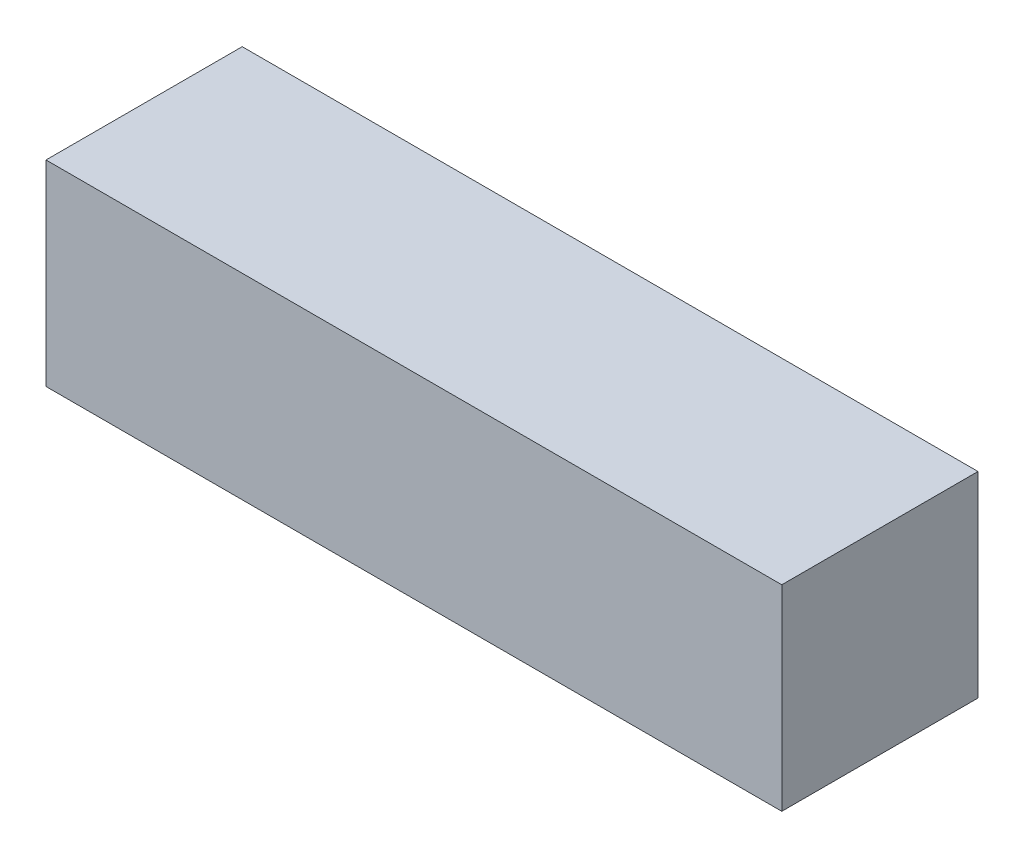
ISO-10303-21;
HEADER;
FILE_DESCRIPTION(('STEP AP214'),'2;1');
FILE_NAME('part.step','',(''),(''),'','','');
FILE_SCHEMA(('AUTOMOTIVE_DESIGN { 1 0 10303 214 1 1 1 1 }'));
ENDSEC;
DATA;
#1=APPLICATION_CONTEXT('core data for automotive mechanical design processes');
#2=APPLICATION_PROTOCOL_DEFINITION('international standard','automotive_design',2000,#1);
#3=PRODUCT_CONTEXT('',#1,'mechanical');
#4=PRODUCT('Part','Part','',(#3));
#5=PRODUCT_RELATED_PRODUCT_CATEGORY('part','',(#4));
#6=PRODUCT_DEFINITION_FORMATION('','',#4);
#7=PRODUCT_DEFINITION_CONTEXT('part definition',#1,'design');
#8=PRODUCT_DEFINITION('design','',#6,#7);
#9=PRODUCT_DEFINITION_SHAPE('','',#8);
#10=(LENGTH_UNIT() NAMED_UNIT(*) SI_UNIT(.MILLI.,.METRE.));
#11=(NAMED_UNIT(*) PLANE_ANGLE_UNIT() SI_UNIT($,.RADIAN.));
#12=(NAMED_UNIT(*) SI_UNIT($,.STERADIAN.) SOLID_ANGLE_UNIT());
#13=UNCERTAINTY_MEASURE_WITH_UNIT(LENGTH_MEASURE(1.E-05),#10,'distance_accuracy_value','');
#14=(GEOMETRIC_REPRESENTATION_CONTEXT(3) GLOBAL_UNCERTAINTY_ASSIGNED_CONTEXT((#13)) GLOBAL_UNIT_ASSIGNED_CONTEXT((#10,
#11,#12)) REPRESENTATION_CONTEXT('',''));
#15=CARTESIAN_POINT('',(0.,0.,0.));
#16=DIRECTION('',(0.,0.,1.));
#17=DIRECTION('',(1.,0.,0.));
#18=AXIS2_PLACEMENT_3D('',#15,#16,#17);
#19=CARTESIAN_POINT('',(-1.5,-1.7,0.2));
#20=DIRECTION('',(0.,1.,0.));
#21=DIRECTION('',(0.,0.,1.));
#22=AXIS2_PLACEMENT_3D('',#19,#20,#21);
#23=PLANE('',#22);
#24=DIRECTION('',(-1.,0.,0.));
#25=VECTOR('',#24,1.);
#26=CARTESIAN_POINT('',(-0.75,-1.7,0.));
#27=LINE('',#26,#25);
#28=CARTESIAN_POINT('',(-0.75,-1.7,0.));
#29=VERTEX_POINT('',#28);
#30=CARTESIAN_POINT('',(-2.25,-1.7,0.));
#31=VERTEX_POINT('',#30);
#32=EDGE_CURVE('E68',#29,#31,#27,.T.);
#33=ORIENTED_EDGE('',*,*,#32,.F.);
#34=DIRECTION('',(0.,0.,-1.));
#35=VECTOR('',#34,1.);
#36=CARTESIAN_POINT('',(-0.75,-1.7,0.4));
#37=LINE('',#36,#35);
#38=CARTESIAN_POINT('',(-0.75,-1.7,0.4));
#39=VERTEX_POINT('',#38);
#40=EDGE_CURVE('E55',#39,#29,#37,.T.);
#41=ORIENTED_EDGE('',*,*,#40,.F.);
#42=DIRECTION('',(1.,0.,0.));
#43=VECTOR('',#42,1.);
#44=CARTESIAN_POINT('',(-2.25,-1.7,0.4));
#45=LINE('',#44,#43);
#46=CARTESIAN_POINT('',(-2.25,-1.7,0.4));
#47=VERTEX_POINT('',#46);
#48=EDGE_CURVE('E20',#47,#39,#45,.T.);
#49=ORIENTED_EDGE('',*,*,#48,.F.);
#50=DIRECTION('',(0.,0.,1.));
#51=VECTOR('',#50,1.);
#52=CARTESIAN_POINT('',(-2.25,-1.7,0.));
#53=LINE('',#52,#51);
#54=EDGE_CURVE('E80',#31,#47,#53,.T.);
#55=ORIENTED_EDGE('',*,*,#54,.F.);
#56=EDGE_LOOP('',(#33,#41,#49,#55));
#57=FACE_BOUND('',#56,.T.);
#58=ADVANCED_FACE('F17',(#57),#23,.F.);
#59=CARTESIAN_POINT('',(-2.25,-1.3,0.4));
#60=DIRECTION('',(0.,0.,1.));
#61=DIRECTION('',(1.,0.,0.));
#62=AXIS2_PLACEMENT_3D('',#59,#60,#61);
#63=PLANE('',#62);
#64=DIRECTION('',(0.,1.,0.));
#65=VECTOR('',#64,1.);
#66=CARTESIAN_POINT('',(-0.75,-1.3,0.4));
#67=LINE('',#66,#65);
#68=CARTESIAN_POINT('',(-0.75,-1.3,0.4));
#69=VERTEX_POINT('',#68);
#70=EDGE_CURVE('E61',#69,#39,#67,.F.);
#71=ORIENTED_EDGE('',*,*,#70,.F.);
#72=DIRECTION('',(1.,0.,0.));
#73=VECTOR('',#72,1.);
#74=CARTESIAN_POINT('',(-1.5,-1.3,0.4));
#75=LINE('',#74,#73);
#76=CARTESIAN_POINT('',(-2.25,-1.3,0.4));
#77=VERTEX_POINT('',#76);
#78=EDGE_CURVE('E83',#77,#69,#75,.T.);
#79=ORIENTED_EDGE('',*,*,#78,.F.);
#80=DIRECTION('',(0.,1.,0.));
#81=VECTOR('',#80,1.);
#82=CARTESIAN_POINT('',(-2.25,-1.3,0.4));
#83=LINE('',#82,#81);
#84=EDGE_CURVE('E64',#47,#77,#83,.T.);
#85=ORIENTED_EDGE('',*,*,#84,.F.);
#86=ORIENTED_EDGE('',*,*,#48,.T.);
#87=EDGE_LOOP('',(#71,#79,#85,#86));
#88=FACE_BOUND('',#87,.T.);
#89=ADVANCED_FACE('F60',(#88),#63,.T.);
#90=CARTESIAN_POINT('',(-0.75,-1.3,0.4));
#91=DIRECTION('',(1.,0.,0.));
#92=DIRECTION('',(0.,0.,-1.));
#93=AXIS2_PLACEMENT_3D('',#90,#91,#92);
#94=PLANE('',#93);
#95=DIRECTION('',(0.,1.,0.));
#96=VECTOR('',#95,1.);
#97=CARTESIAN_POINT('',(-0.75,-1.3,0.));
#98=LINE('',#97,#96);
#99=CARTESIAN_POINT('',(-0.75,-1.3,0.));
#100=VERTEX_POINT('',#99);
#101=EDGE_CURVE('E70',#100,#29,#98,.F.);
#102=ORIENTED_EDGE('',*,*,#101,.F.);
#103=DIRECTION('',(0.,0.,1.));
#104=VECTOR('',#103,1.);
#105=CARTESIAN_POINT('',(-0.75,-1.3,0.2));
#106=LINE('',#105,#104);
#107=EDGE_CURVE('E74',#69,#100,#106,.F.);
#108=ORIENTED_EDGE('',*,*,#107,.F.);
#109=ORIENTED_EDGE('',*,*,#70,.T.);
#110=ORIENTED_EDGE('',*,*,#40,.T.);
#111=EDGE_LOOP('',(#102,#108,#109,#110));
#112=FACE_BOUND('',#111,.T.);
#113=ADVANCED_FACE('F72',(#112),#94,.T.);
#114=CARTESIAN_POINT('',(-0.75,-1.3,0.));
#115=DIRECTION('',(0.,0.,-1.));
#116=DIRECTION('',(-1.,0.,0.));
#117=AXIS2_PLACEMENT_3D('',#114,#115,#116);
#118=PLANE('',#117);
#119=DIRECTION('',(0.,1.,0.));
#120=VECTOR('',#119,1.);
#121=CARTESIAN_POINT('',(-2.25,-1.3,0.));
#122=LINE('',#121,#120);
#123=CARTESIAN_POINT('',(-2.25,-1.3,0.));
#124=VERTEX_POINT('',#123);
#125=EDGE_CURVE('E35',#124,#31,#122,.F.);
#126=ORIENTED_EDGE('',*,*,#125,.F.);
#127=DIRECTION('',(1.,0.,0.));
#128=VECTOR('',#127,1.);
#129=CARTESIAN_POINT('',(-1.5,-1.3,0.));
#130=LINE('',#129,#128);
#131=EDGE_CURVE('E26',#100,#124,#130,.F.);
#132=ORIENTED_EDGE('',*,*,#131,.F.);
#133=ORIENTED_EDGE('',*,*,#101,.T.);
#134=ORIENTED_EDGE('',*,*,#32,.T.);
#135=EDGE_LOOP('',(#126,#132,#133,#134));
#136=FACE_BOUND('',#135,.T.);
#137=ADVANCED_FACE('F89',(#136),#118,.T.);
#138=CARTESIAN_POINT('',(-2.25,-1.3,0.));
#139=DIRECTION('',(-1.,0.,0.));
#140=DIRECTION('',(0.,0.,1.));
#141=AXIS2_PLACEMENT_3D('',#138,#139,#140);
#142=PLANE('',#141);
#143=ORIENTED_EDGE('',*,*,#84,.T.);
#144=DIRECTION('',(0.,0.,1.));
#145=VECTOR('',#144,1.);
#146=CARTESIAN_POINT('',(-2.25,-1.3,0.2));
#147=LINE('',#146,#145);
#148=EDGE_CURVE('E11',#124,#77,#147,.T.);
#149=ORIENTED_EDGE('',*,*,#148,.F.);
#150=ORIENTED_EDGE('',*,*,#125,.T.);
#151=ORIENTED_EDGE('',*,*,#54,.T.);
#152=EDGE_LOOP('',(#143,#149,#150,#151));
#153=FACE_BOUND('',#152,.T.);
#154=ADVANCED_FACE('F91',(#153),#142,.T.);
#155=CARTESIAN_POINT('',(-1.5,-1.3,0.2));
#156=DIRECTION('',(0.,1.,0.));
#157=DIRECTION('',(0.,0.,1.));
#158=AXIS2_PLACEMENT_3D('',#155,#156,#157);
#159=PLANE('',#158);
#160=ORIENTED_EDGE('',*,*,#131,.T.);
#161=ORIENTED_EDGE('',*,*,#148,.T.);
#162=ORIENTED_EDGE('',*,*,#78,.T.);
#163=ORIENTED_EDGE('',*,*,#107,.T.);
#164=EDGE_LOOP('',(#160,#161,#162,#163));
#165=FACE_BOUND('',#164,.T.);
#166=ADVANCED_FACE('F88',(#165),#159,.T.);
#167=CLOSED_SHELL('',(#58,#89,#113,#137,#154,#166));
#168=MANIFOLD_SOLID_BREP('B1',#167);
#169=ADVANCED_BREP_SHAPE_REPRESENTATION('',(#18,#168),#14);
#170=SHAPE_DEFINITION_REPRESENTATION(#9,#169);
ENDSEC;
END-ISO-10303-21;
